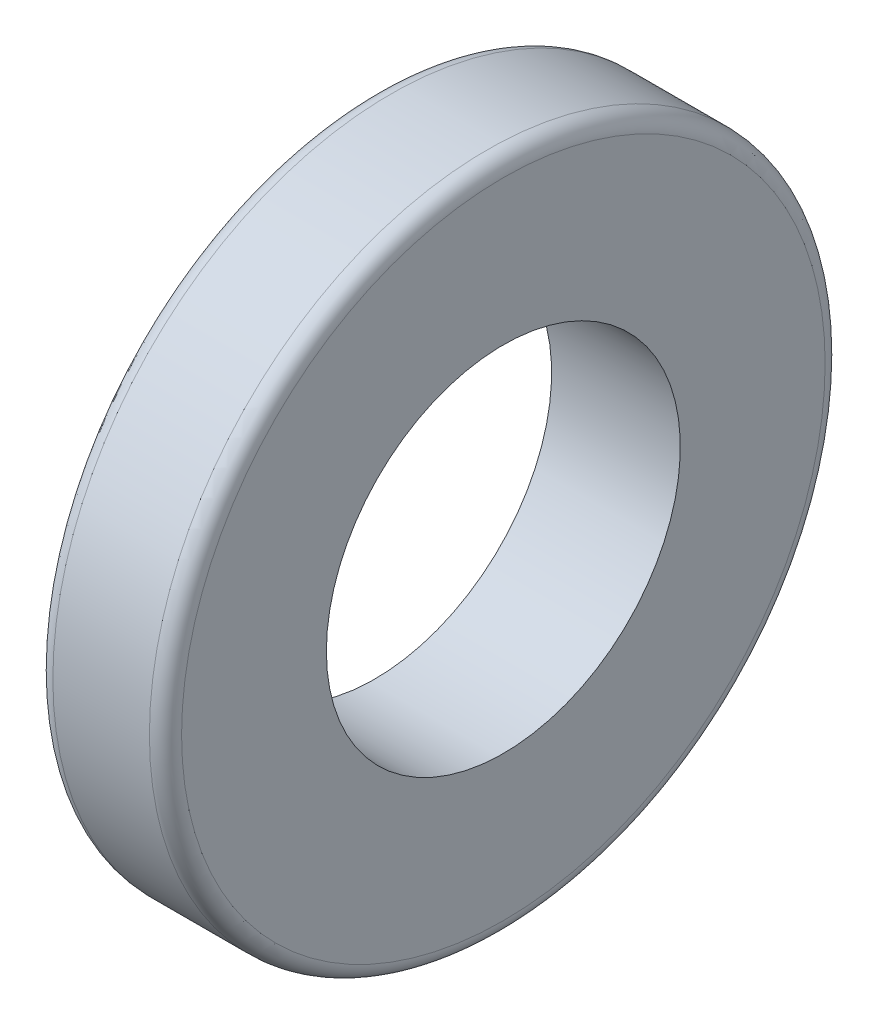
ISO-10303-21;
HEADER;
FILE_DESCRIPTION(('STEP AP214'),'2;1');
FILE_NAME('part.step','',(''),(''),'','','');
FILE_SCHEMA(('AUTOMOTIVE_DESIGN { 1 0 10303 214 1 1 1 1 }'));
ENDSEC;
DATA;
#1=APPLICATION_CONTEXT('core data for automotive mechanical design processes');
#2=APPLICATION_PROTOCOL_DEFINITION('international standard','automotive_design',2000,#1);
#3=PRODUCT_CONTEXT('',#1,'mechanical');
#4=PRODUCT('Part','Part','',(#3));
#5=PRODUCT_RELATED_PRODUCT_CATEGORY('part','',(#4));
#6=PRODUCT_DEFINITION_FORMATION('','',#4);
#7=PRODUCT_DEFINITION_CONTEXT('part definition',#1,'design');
#8=PRODUCT_DEFINITION('design','',#6,#7);
#9=PRODUCT_DEFINITION_SHAPE('','',#8);
#10=(LENGTH_UNIT() NAMED_UNIT(*) SI_UNIT(.MILLI.,.METRE.));
#11=(NAMED_UNIT(*) PLANE_ANGLE_UNIT() SI_UNIT($,.RADIAN.));
#12=(NAMED_UNIT(*) SI_UNIT($,.STERADIAN.) SOLID_ANGLE_UNIT());
#13=UNCERTAINTY_MEASURE_WITH_UNIT(LENGTH_MEASURE(1.E-05),#10,'distance_accuracy_value','');
#14=(GEOMETRIC_REPRESENTATION_CONTEXT(3) GLOBAL_UNCERTAINTY_ASSIGNED_CONTEXT((#13)) GLOBAL_UNIT_ASSIGNED_CONTEXT((#10,
#11,#12)) REPRESENTATION_CONTEXT('',''));
#15=CARTESIAN_POINT('',(0.,0.,0.));
#16=DIRECTION('',(0.,0.,1.));
#17=DIRECTION('',(1.,0.,0.));
#18=AXIS2_PLACEMENT_3D('',#15,#16,#17);
#19=CARTESIAN_POINT('',(0.,0.,0.));
#20=DIRECTION('',(-1.,0.,0.));
#21=DIRECTION('',(0.,0.,1.));
#22=AXIS2_PLACEMENT_3D('',#19,#20,#21);
#23=CYLINDRICAL_SURFACE('',#22,5.5);
#24=CARTESIAN_POINT('',(5.,0.,0.));
#25=DIRECTION('',(-1.,0.,0.));
#26=DIRECTION('',(0.,0.,1.));
#27=AXIS2_PLACEMENT_3D('',#24,#25,#26);
#28=CIRCLE('',#27,5.5);
#29=CARTESIAN_POINT('',(5.,0.,5.5));
#30=VERTEX_POINT('',#29);
#31=EDGE_CURVE('E65',#30,#30,#28,.T.);
#32=ORIENTED_EDGE('',*,*,#31,.F.);
#33=EDGE_LOOP('',(#32));
#34=FACE_BOUND('',#33,.T.);
#35=CARTESIAN_POINT('',(1.,0.,0.));
#36=DIRECTION('',(-1.,0.,0.));
#37=DIRECTION('',(0.,0.,1.));
#38=AXIS2_PLACEMENT_3D('',#35,#36,#37);
#39=CIRCLE('',#38,5.5);
#40=CARTESIAN_POINT('',(1.,0.,5.5));
#41=VERTEX_POINT('',#40);
#42=EDGE_CURVE('E61',#41,#41,#39,.T.);
#43=ORIENTED_EDGE('',*,*,#42,.T.);
#44=EDGE_LOOP('',(#43));
#45=FACE_BOUND('',#44,.T.);
#46=ADVANCED_FACE('F37',(#34,#45),#23,.F.);
#47=CARTESIAN_POINT('',(1.,10.5,0.));
#48=DIRECTION('',(1.,0.,0.));
#49=DIRECTION('',(0.,0.,-1.));
#50=AXIS2_PLACEMENT_3D('',#47,#48,#49);
#51=PLANE('',#50);
#52=CARTESIAN_POINT('',(1.,0.,0.));
#53=DIRECTION('',(1.,0.,0.));
#54=DIRECTION('',(0.,0.,-1.));
#55=AXIS2_PLACEMENT_3D('',#52,#53,#54);
#56=CIRCLE('',#55,10.);
#57=CARTESIAN_POINT('',(1.,0.,-10.));
#58=VERTEX_POINT('',#57);
#59=EDGE_CURVE('E55',#58,#58,#56,.F.);
#60=ORIENTED_EDGE('',*,*,#59,.T.);
#61=EDGE_LOOP('',(#60));
#62=FACE_BOUND('',#61,.T.);
#63=ORIENTED_EDGE('',*,*,#42,.F.);
#64=EDGE_LOOP('',(#63));
#65=FACE_BOUND('',#64,.T.);
#66=ADVANCED_FACE('F74',(#62,#65),#51,.F.);
#67=CARTESIAN_POINT('',(0.,0.,0.));
#68=DIRECTION('',(-1.,0.,0.));
#69=DIRECTION('',(0.,0.,1.));
#70=AXIS2_PLACEMENT_3D('',#67,#68,#69);
#71=CYLINDRICAL_SURFACE('',#70,10.5);
#72=CARTESIAN_POINT('',(1.5,0.,0.));
#73=DIRECTION('',(1.,0.,0.));
#74=DIRECTION('',(0.,0.,-1.));
#75=AXIS2_PLACEMENT_3D('',#72,#73,#74);
#76=CIRCLE('',#75,10.5);
#77=CARTESIAN_POINT('',(1.5,0.,-10.5));
#78=VERTEX_POINT('',#77);
#79=EDGE_CURVE('E45',#78,#78,#76,.T.);
#80=ORIENTED_EDGE('',*,*,#79,.T.);
#81=EDGE_LOOP('',(#80));
#82=FACE_BOUND('',#81,.T.);
#83=CARTESIAN_POINT('',(4.5,0.,0.));
#84=DIRECTION('',(1.,0.,0.));
#85=DIRECTION('',(0.,0.,-1.));
#86=AXIS2_PLACEMENT_3D('',#83,#84,#85);
#87=CIRCLE('',#86,10.5);
#88=CARTESIAN_POINT('',(4.5,0.,-10.5));
#89=VERTEX_POINT('',#88);
#90=EDGE_CURVE('E50',#89,#89,#87,.F.);
#91=ORIENTED_EDGE('',*,*,#90,.T.);
#92=EDGE_LOOP('',(#91));
#93=FACE_BOUND('',#92,.T.);
#94=ADVANCED_FACE('F79',(#82,#93),#71,.T.);
#95=CARTESIAN_POINT('',(5.,10.5,0.));
#96=DIRECTION('',(1.,0.,0.));
#97=DIRECTION('',(0.,0.,-1.));
#98=AXIS2_PLACEMENT_3D('',#95,#96,#97);
#99=PLANE('',#98);
#100=CARTESIAN_POINT('',(5.,0.,0.));
#101=DIRECTION('',(1.,0.,0.));
#102=DIRECTION('',(0.,0.,-1.));
#103=AXIS2_PLACEMENT_3D('',#100,#101,#102);
#104=CIRCLE('',#103,10.);
#105=CARTESIAN_POINT('',(5.,0.,-10.));
#106=VERTEX_POINT('',#105);
#107=EDGE_CURVE('E10',#106,#106,#104,.T.);
#108=ORIENTED_EDGE('',*,*,#107,.T.);
#109=EDGE_LOOP('',(#108));
#110=FACE_BOUND('',#109,.T.);
#111=ORIENTED_EDGE('',*,*,#31,.T.);
#112=EDGE_LOOP('',(#111));
#113=FACE_BOUND('',#112,.T.);
#114=ADVANCED_FACE('F70',(#110,#113),#99,.T.);
#115=CARTESIAN_POINT('',(1.5,0.,0.));
#116=DIRECTION('',(1.,0.,0.));
#117=DIRECTION('',(0.,0.,-1.));
#118=AXIS2_PLACEMENT_3D('',#115,#116,#117);
#119=TOROIDAL_SURFACE('',#118,10.,0.5);
#120=ORIENTED_EDGE('',*,*,#79,.F.);
#121=EDGE_LOOP('',(#120));
#122=FACE_BOUND('',#121,.T.);
#123=ORIENTED_EDGE('',*,*,#59,.F.);
#124=EDGE_LOOP('',(#123));
#125=FACE_BOUND('',#124,.T.);
#126=ADVANCED_FACE('F87',(#122,#125),#119,.T.);
#127=CARTESIAN_POINT('',(4.5,0.,0.));
#128=DIRECTION('',(1.,0.,0.));
#129=DIRECTION('',(0.,0.,-1.));
#130=AXIS2_PLACEMENT_3D('',#127,#128,#129);
#131=TOROIDAL_SURFACE('',#130,10.,0.5);
#132=ORIENTED_EDGE('',*,*,#107,.F.);
#133=EDGE_LOOP('',(#132));
#134=FACE_BOUND('',#133,.T.);
#135=ORIENTED_EDGE('',*,*,#90,.F.);
#136=EDGE_LOOP('',(#135));
#137=FACE_BOUND('',#136,.T.);
#138=ADVANCED_FACE('F39',(#134,#137),#131,.T.);
#139=CLOSED_SHELL('',(#46,#66,#94,#114,#126,#138));
#140=MANIFOLD_SOLID_BREP('B2',#139);
#141=ADVANCED_BREP_SHAPE_REPRESENTATION('',(#18,#140),#14);
#142=SHAPE_DEFINITION_REPRESENTATION(#9,#141);
ENDSEC;
END-ISO-10303-21;
